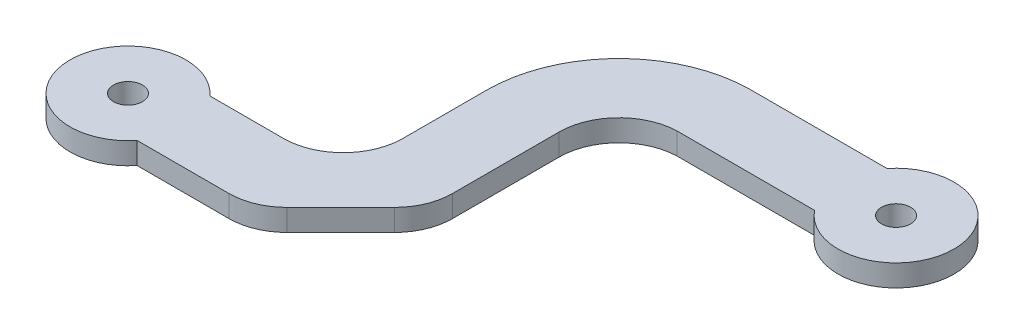
ISO-10303-21;
HEADER;
FILE_DESCRIPTION(('STEP AP214'),'2;1');
FILE_NAME('part.step','',(''),(''),'','','');
FILE_SCHEMA(('AUTOMOTIVE_DESIGN { 1 0 10303 214 1 1 1 1 }'));
ENDSEC;
DATA;
#1=APPLICATION_CONTEXT('core data for automotive mechanical design processes');
#2=APPLICATION_PROTOCOL_DEFINITION('international standard','automotive_design',2000,#1);
#3=PRODUCT_CONTEXT('',#1,'mechanical');
#4=PRODUCT('Part','Part','',(#3));
#5=PRODUCT_RELATED_PRODUCT_CATEGORY('part','',(#4));
#6=PRODUCT_DEFINITION_FORMATION('','',#4);
#7=PRODUCT_DEFINITION_CONTEXT('part definition',#1,'design');
#8=PRODUCT_DEFINITION('design','',#6,#7);
#9=PRODUCT_DEFINITION_SHAPE('','',#8);
#10=(LENGTH_UNIT() NAMED_UNIT(*) SI_UNIT(.MILLI.,.METRE.));
#11=(NAMED_UNIT(*) PLANE_ANGLE_UNIT() SI_UNIT($,.RADIAN.));
#12=(NAMED_UNIT(*) SI_UNIT($,.STERADIAN.) SOLID_ANGLE_UNIT());
#13=UNCERTAINTY_MEASURE_WITH_UNIT(LENGTH_MEASURE(1.E-05),#10,'distance_accuracy_value','');
#14=(GEOMETRIC_REPRESENTATION_CONTEXT(3) GLOBAL_UNCERTAINTY_ASSIGNED_CONTEXT((#13)) GLOBAL_UNIT_ASSIGNED_CONTEXT((#10,
#11,#12)) REPRESENTATION_CONTEXT('',''));
#15=CARTESIAN_POINT('',(0.,0.,0.));
#16=DIRECTION('',(0.,0.,1.));
#17=DIRECTION('',(1.,0.,0.));
#18=AXIS2_PLACEMENT_3D('',#15,#16,#17);
#19=CARTESIAN_POINT('',(0.,1.5,-16.6884298667005));
#20=DIRECTION('',(0.,0.,-1.));
#21=DIRECTION('',(-1.,0.,0.));
#22=AXIS2_PLACEMENT_3D('',#19,#20,#21);
#23=PLANE('',#22);
#24=DIRECTION('',(1.,0.,0.));
#25=VECTOR('',#24,1.);
#26=CARTESIAN_POINT('',(0.,0.,-16.6884298667005));
#27=LINE('',#26,#25);
#28=CARTESIAN_POINT('',(21.1654014208039,0.,-16.6884298667005));
#29=VERTEX_POINT('',#28);
#30=CARTESIAN_POINT('',(30.6654014208039,0.,-16.6884298667005));
#31=VERTEX_POINT('',#30);
#32=EDGE_CURVE('E177',#29,#31,#27,.T.);
#33=ORIENTED_EDGE('',*,*,#32,.T.);
#34=DIRECTION('',(0.,-1.,0.));
#35=VECTOR('',#34,1.);
#36=CARTESIAN_POINT('',(30.6654014208039,1.5,-16.6884298667005));
#37=LINE('',#36,#35);
#38=CARTESIAN_POINT('',(30.6654014208039,1.5,-16.6884298667005));
#39=VERTEX_POINT('',#38);
#40=EDGE_CURVE('E156',#39,#31,#37,.T.);
#41=ORIENTED_EDGE('',*,*,#40,.F.);
#42=DIRECTION('',(1.,0.,0.));
#43=VECTOR('',#42,1.);
#44=CARTESIAN_POINT('',(0.,1.5,-16.6884298667005));
#45=LINE('',#44,#43);
#46=CARTESIAN_POINT('',(21.1654014208039,1.5,-16.6884298667005));
#47=VERTEX_POINT('',#46);
#48=EDGE_CURVE('E164',#47,#39,#45,.T.);
#49=ORIENTED_EDGE('',*,*,#48,.F.);
#50=DIRECTION('',(0.,-1.,0.));
#51=VECTOR('',#50,1.);
#52=CARTESIAN_POINT('',(21.1654014208039,1.5,-16.6884298667005));
#53=LINE('',#52,#51);
#54=EDGE_CURVE('E254',#47,#29,#53,.T.);
#55=ORIENTED_EDGE('',*,*,#54,.T.);
#56=EDGE_LOOP('',(#33,#41,#49,#55));
#57=FACE_BOUND('',#56,.T.);
#58=ADVANCED_FACE('F45',(#57),#23,.F.);
#59=CARTESIAN_POINT('',(33.7879004200031,1.5,-19.1884298667005));
#60=DIRECTION('',(0.,-1.,0.));
#61=DIRECTION('',(0.,0.,-1.));
#62=AXIS2_PLACEMENT_3D('',#59,#60,#61);
#63=CYLINDRICAL_SURFACE('',#62,4.);
#64=CARTESIAN_POINT('',(33.7879004200031,0.,-19.1884298667005));
#65=DIRECTION('',(0.,1.,0.));
#66=DIRECTION('',(0.,0.,1.));
#67=AXIS2_PLACEMENT_3D('',#64,#65,#66);
#68=CIRCLE('',#67,4.);
#69=CARTESIAN_POINT('',(30.6654014208039,0.,-21.6884298667005));
#70=VERTEX_POINT('',#69);
#71=EDGE_CURVE('E257',#31,#70,#68,.T.);
#72=ORIENTED_EDGE('',*,*,#71,.T.);
#73=DIRECTION('',(0.,-1.,0.));
#74=VECTOR('',#73,1.);
#75=CARTESIAN_POINT('',(30.6654014208039,1.5,-21.6884298667005));
#76=LINE('',#75,#74);
#77=CARTESIAN_POINT('',(30.6654014208039,1.5,-21.6884298667005));
#78=VERTEX_POINT('',#77);
#79=EDGE_CURVE('E158',#78,#70,#76,.T.);
#80=ORIENTED_EDGE('',*,*,#79,.F.);
#81=CARTESIAN_POINT('',(33.7879004200031,1.5,-19.1884298667005));
#82=DIRECTION('',(0.,1.,0.));
#83=DIRECTION('',(0.,0.,1.));
#84=AXIS2_PLACEMENT_3D('',#81,#82,#83);
#85=CIRCLE('',#84,4.);
#86=EDGE_CURVE('E151',#39,#78,#85,.T.);
#87=ORIENTED_EDGE('',*,*,#86,.F.);
#88=ORIENTED_EDGE('',*,*,#40,.T.);
#89=EDGE_LOOP('',(#72,#80,#87,#88));
#90=FACE_BOUND('',#89,.T.);
#91=ADVANCED_FACE('F154',(#90),#63,.T.);
#92=CARTESIAN_POINT('',(0.,1.5,-21.6884298667005));
#93=DIRECTION('',(0.,0.,-1.));
#94=DIRECTION('',(-1.,0.,0.));
#95=AXIS2_PLACEMENT_3D('',#92,#93,#94);
#96=PLANE('',#95);
#97=DIRECTION('',(1.,0.,0.));
#98=VECTOR('',#97,1.);
#99=CARTESIAN_POINT('',(0.,0.,-21.6884298667005));
#100=LINE('',#99,#98);
#101=CARTESIAN_POINT('',(21.1654014208039,0.,-21.6884298667005));
#102=VERTEX_POINT('',#101);
#103=EDGE_CURVE('E260',#102,#70,#100,.T.);
#104=ORIENTED_EDGE('',*,*,#103,.F.);
#105=DIRECTION('',(0.,-1.,0.));
#106=VECTOR('',#105,1.);
#107=CARTESIAN_POINT('',(21.1654014208039,1.5,-21.6884298667005));
#108=LINE('',#107,#106);
#109=CARTESIAN_POINT('',(21.1654014208039,1.5,-21.6884298667005));
#110=VERTEX_POINT('',#109);
#111=EDGE_CURVE('E186',#110,#102,#108,.T.);
#112=ORIENTED_EDGE('',*,*,#111,.F.);
#113=DIRECTION('',(1.,0.,0.));
#114=VECTOR('',#113,1.);
#115=CARTESIAN_POINT('',(0.,1.5,-21.6884298667005));
#116=LINE('',#115,#114);
#117=EDGE_CURVE('E163',#110,#78,#116,.T.);
#118=ORIENTED_EDGE('',*,*,#117,.T.);
#119=ORIENTED_EDGE('',*,*,#79,.T.);
#120=EDGE_LOOP('',(#104,#112,#118,#119));
#121=FACE_BOUND('',#120,.T.);
#122=ADVANCED_FACE('F322',(#121),#96,.T.);
#123=CARTESIAN_POINT('',(21.3121067344316,1.5,-12.5528340469568));
#124=DIRECTION('',(0.,-1.,0.));
#125=DIRECTION('',(0.,0.,-1.));
#126=AXIS2_PLACEMENT_3D('',#123,#124,#125);
#127=CYLINDRICAL_SURFACE('',#126,9.13677368827553);
#128=CARTESIAN_POINT('',(21.3121067344316,0.,-12.5528340469568));
#129=DIRECTION('',(0.,1.,0.));
#130=DIRECTION('',(0.,0.,1.));
#131=AXIS2_PLACEMENT_3D('',#128,#129,#130);
#132=CIRCLE('',#131,9.13677368827553);
#133=CARTESIAN_POINT('',(12.175333046156,0.,-12.5528340469568));
#134=VERTEX_POINT('',#133);
#135=EDGE_CURVE('E264',#134,#102,#132,.F.);
#136=ORIENTED_EDGE('',*,*,#135,.F.);
#137=DIRECTION('',(0.,-1.,0.));
#138=VECTOR('',#137,1.);
#139=CARTESIAN_POINT('',(12.175333046156,1.5,-12.5528340469568));
#140=LINE('',#139,#138);
#141=CARTESIAN_POINT('',(12.175333046156,1.5,-12.5528340469568));
#142=VERTEX_POINT('',#141);
#143=EDGE_CURVE('E313',#142,#134,#140,.T.);
#144=ORIENTED_EDGE('',*,*,#143,.F.);
#145=CARTESIAN_POINT('',(21.3121067344316,1.5,-12.5528340469568));
#146=DIRECTION('',(0.,1.,0.));
#147=DIRECTION('',(0.,0.,1.));
#148=AXIS2_PLACEMENT_3D('',#145,#146,#147);
#149=CIRCLE('',#148,9.13677368827553);
#150=EDGE_CURVE('E225',#142,#110,#149,.F.);
#151=ORIENTED_EDGE('',*,*,#150,.T.);
#152=ORIENTED_EDGE('',*,*,#111,.T.);
#153=EDGE_LOOP('',(#136,#144,#151,#152));
#154=FACE_BOUND('',#153,.T.);
#155=ADVANCED_FACE('F319',(#154),#127,.T.);
#156=CARTESIAN_POINT('',(12.175333046156,1.5,0.));
#157=DIRECTION('',(1.,0.,0.));
#158=DIRECTION('',(0.,0.,-1.));
#159=AXIS2_PLACEMENT_3D('',#156,#157,#158);
#160=PLANE('',#159);
#161=DIRECTION('',(0.,0.,1.));
#162=VECTOR('',#161,1.);
#163=CARTESIAN_POINT('',(12.175333046156,0.,0.));
#164=LINE('',#163,#162);
#165=CARTESIAN_POINT('',(12.175333046156,0.,-6.79016646565049));
#166=VERTEX_POINT('',#165);
#167=EDGE_CURVE('E268',#134,#166,#164,.T.);
#168=ORIENTED_EDGE('',*,*,#167,.T.);
#169=DIRECTION('',(0.,-1.,0.));
#170=VECTOR('',#169,1.);
#171=CARTESIAN_POINT('',(12.175333046156,1.5,-6.79016646565049));
#172=LINE('',#171,#170);
#173=CARTESIAN_POINT('',(12.175333046156,1.5,-6.79016646565049));
#174=VERTEX_POINT('',#173);
#175=EDGE_CURVE('E310',#174,#166,#172,.T.);
#176=ORIENTED_EDGE('',*,*,#175,.F.);
#177=DIRECTION('',(0.,0.,1.));
#178=VECTOR('',#177,1.);
#179=CARTESIAN_POINT('',(12.175333046156,1.5,0.));
#180=LINE('',#179,#178);
#181=EDGE_CURVE('E229',#142,#174,#180,.T.);
#182=ORIENTED_EDGE('',*,*,#181,.F.);
#183=ORIENTED_EDGE('',*,*,#143,.T.);
#184=EDGE_LOOP('',(#168,#176,#182,#183));
#185=FACE_BOUND('',#184,.T.);
#186=ADVANCED_FACE('F330',(#185),#160,.F.);
#187=CARTESIAN_POINT('',(8.05533304633386,1.5,-6.79016646565049));
#188=DIRECTION('',(0.,-1.,0.));
#189=DIRECTION('',(0.,0.,-1.));
#190=AXIS2_PLACEMENT_3D('',#187,#188,#189);
#191=CYLINDRICAL_SURFACE('',#190,4.11999999982218);
#192=CARTESIAN_POINT('',(8.05533304633386,0.,-6.79016646565049));
#193=DIRECTION('',(0.,1.,0.));
#194=DIRECTION('',(0.,0.,1.));
#195=AXIS2_PLACEMENT_3D('',#192,#193,#194);
#196=CIRCLE('',#195,4.11999999982218);
#197=CARTESIAN_POINT('',(8.05533304633386,0.,-2.67016646582831));
#198=VERTEX_POINT('',#197);
#199=EDGE_CURVE('E272',#198,#166,#196,.T.);
#200=ORIENTED_EDGE('',*,*,#199,.F.);
#201=DIRECTION('',(0.,-1.,0.));
#202=VECTOR('',#201,1.);
#203=CARTESIAN_POINT('',(8.05533304633386,1.5,-2.67016646582831));
#204=LINE('',#203,#202);
#205=CARTESIAN_POINT('',(8.05533304633386,1.5,-2.67016646582831));
#206=VERTEX_POINT('',#205);
#207=EDGE_CURVE('E307',#206,#198,#204,.T.);
#208=ORIENTED_EDGE('',*,*,#207,.F.);
#209=CARTESIAN_POINT('',(8.05533304633386,1.5,-6.79016646565049));
#210=DIRECTION('',(0.,1.,0.));
#211=DIRECTION('',(0.,0.,1.));
#212=AXIS2_PLACEMENT_3D('',#209,#210,#211);
#213=CIRCLE('',#212,4.11999999982218);
#214=EDGE_CURVE('E232',#206,#174,#213,.T.);
#215=ORIENTED_EDGE('',*,*,#214,.T.);
#216=ORIENTED_EDGE('',*,*,#175,.T.);
#217=EDGE_LOOP('',(#200,#208,#215,#216));
#218=FACE_BOUND('',#217,.T.);
#219=ADVANCED_FACE('F485',(#218),#191,.F.);
#220=CARTESIAN_POINT('',(0.,1.5,-2.67016646582831));
#221=DIRECTION('',(0.,0.,-1.));
#222=DIRECTION('',(-1.,0.,0.));
#223=AXIS2_PLACEMENT_3D('',#220,#221,#222);
#224=PLANE('',#223);
#225=DIRECTION('',(1.,0.,0.));
#226=VECTOR('',#225,1.);
#227=CARTESIAN_POINT('',(0.,0.,-2.67016646582831));
#228=LINE('',#227,#226);
#229=CARTESIAN_POINT('',(2.97828995310497,0.,-2.67016646582831));
#230=VERTEX_POINT('',#229);
#231=EDGE_CURVE('E276',#230,#198,#228,.T.);
#232=ORIENTED_EDGE('',*,*,#231,.F.);
#233=DIRECTION('',(0.,-1.,0.));
#234=VECTOR('',#233,1.);
#235=CARTESIAN_POINT('',(2.97828995310497,1.5,-2.67016646582831));
#236=LINE('',#235,#234);
#237=CARTESIAN_POINT('',(2.97828995310497,1.5,-2.67016646582831));
#238=VERTEX_POINT('',#237);
#239=EDGE_CURVE('E304',#238,#230,#236,.T.);
#240=ORIENTED_EDGE('',*,*,#239,.F.);
#241=DIRECTION('',(1.,0.,0.));
#242=VECTOR('',#241,1.);
#243=CARTESIAN_POINT('',(0.,1.5,-2.67016646582831));
#244=LINE('',#243,#242);
#245=EDGE_CURVE('E236',#238,#206,#244,.T.);
#246=ORIENTED_EDGE('',*,*,#245,.T.);
#247=ORIENTED_EDGE('',*,*,#207,.T.);
#248=EDGE_LOOP('',(#232,#240,#246,#247));
#249=FACE_BOUND('',#248,.T.);
#250=ADVANCED_FACE('F337',(#249),#224,.T.);
#251=CARTESIAN_POINT('',(0.,1.5,0.));
#252=DIRECTION('',(0.,-1.,0.));
#253=DIRECTION('',(0.,0.,-1.));
#254=AXIS2_PLACEMENT_3D('',#251,#252,#253);
#255=CYLINDRICAL_SURFACE('',#254,4.);
#256=CARTESIAN_POINT('',(0.,0.,0.));
#257=DIRECTION('',(0.,1.,0.));
#258=DIRECTION('',(0.,0.,1.));
#259=AXIS2_PLACEMENT_3D('',#256,#257,#258);
#260=CIRCLE('',#259,4.);
#261=CARTESIAN_POINT('',(3.1224989991992,0.,2.5));
#262=VERTEX_POINT('',#261);
#263=EDGE_CURVE('E280',#230,#262,#260,.T.);
#264=ORIENTED_EDGE('',*,*,#263,.T.);
#265=DIRECTION('',(0.,-1.,0.));
#266=VECTOR('',#265,1.);
#267=CARTESIAN_POINT('',(3.1224989991992,1.5,2.5));
#268=LINE('',#267,#266);
#269=CARTESIAN_POINT('',(3.1224989991992,1.5,2.5));
#270=VERTEX_POINT('',#269);
#271=EDGE_CURVE('E300',#270,#262,#268,.T.);
#272=ORIENTED_EDGE('',*,*,#271,.F.);
#273=CARTESIAN_POINT('',(0.,1.5,0.));
#274=DIRECTION('',(0.,1.,0.));
#275=DIRECTION('',(0.,0.,1.));
#276=AXIS2_PLACEMENT_3D('',#273,#274,#275);
#277=CIRCLE('',#276,4.);
#278=EDGE_CURVE('E240',#238,#270,#277,.T.);
#279=ORIENTED_EDGE('',*,*,#278,.F.);
#280=ORIENTED_EDGE('',*,*,#239,.T.);
#281=EDGE_LOOP('',(#264,#272,#279,#280));
#282=FACE_BOUND('',#281,.T.);
#283=ADVANCED_FACE('F342',(#282),#255,.T.);
#284=CARTESIAN_POINT('',(0.,1.5,2.5));
#285=DIRECTION('',(0.,0.,-1.));
#286=DIRECTION('',(-1.,0.,0.));
#287=AXIS2_PLACEMENT_3D('',#284,#285,#286);
#288=PLANE('',#287);
#289=DIRECTION('',(1.,0.,0.));
#290=VECTOR('',#289,1.);
#291=CARTESIAN_POINT('',(0.,0.,2.5));
#292=LINE('',#291,#290);
#293=CARTESIAN_POINT('',(9.46564474970682,0.,2.5));
#294=VERTEX_POINT('',#293);
#295=EDGE_CURVE('E283',#262,#294,#292,.T.);
#296=ORIENTED_EDGE('',*,*,#295,.T.);
#297=DIRECTION('',(0.,-1.,0.));
#298=VECTOR('',#297,1.);
#299=CARTESIAN_POINT('',(9.46564474970682,1.5,2.5));
#300=LINE('',#299,#298);
#301=CARTESIAN_POINT('',(9.46564474970682,1.5,2.5));
#302=VERTEX_POINT('',#301);
#303=EDGE_CURVE('E11',#294,#302,#300,.F.);
#304=ORIENTED_EDGE('',*,*,#303,.T.);
#305=DIRECTION('',(1.,0.,0.));
#306=VECTOR('',#305,1.);
#307=CARTESIAN_POINT('',(0.,1.5,2.5));
#308=LINE('',#307,#306);
#309=EDGE_CURVE('E243',#270,#302,#308,.T.);
#310=ORIENTED_EDGE('',*,*,#309,.F.);
#311=ORIENTED_EDGE('',*,*,#271,.T.);
#312=EDGE_LOOP('',(#296,#304,#310,#311));
#313=FACE_BOUND('',#312,.T.);
#314=ADVANCED_FACE('F460',(#313),#288,.F.);
#315=CARTESIAN_POINT('',(6.8112494995996,1.5,6.8112494995996));
#316=DIRECTION('',(-0.707106781186548,0.,-0.707106781186547));
#317=DIRECTION('',(-0.707106781186547,0.,0.707106781186548));
#318=AXIS2_PLACEMENT_3D('',#315,#316,#317);
#319=PLANE('',#318);
#320=DIRECTION('',(0.707106781186547,0.,-0.707106781186548));
#321=VECTOR('',#320,1.);
#322=CARTESIAN_POINT('',(6.8112494995996,0.,6.8112494995996));
#323=LINE('',#322,#321);
#324=CARTESIAN_POINT('',(12.294071874453,0.,1.32842712474619));
#325=VERTEX_POINT('',#324);
#326=CARTESIAN_POINT('',(16.0037601709022,0.,-2.38126117170304));
#327=VERTEX_POINT('',#326);
#328=EDGE_CURVE('E286',#325,#327,#323,.T.);
#329=ORIENTED_EDGE('',*,*,#328,.T.);
#330=DIRECTION('',(0.,-1.,0.));
#331=VECTOR('',#330,1.);
#332=CARTESIAN_POINT('',(16.0037601709022,1.5,-2.38126117170304));
#333=LINE('',#332,#331);
#334=CARTESIAN_POINT('',(16.0037601709022,1.5,-2.38126117170304));
#335=VERTEX_POINT('',#334);
#336=EDGE_CURVE('E69',#327,#335,#333,.F.);
#337=ORIENTED_EDGE('',*,*,#336,.T.);
#338=DIRECTION('',(0.707106781186547,0.,-0.707106781186548));
#339=VECTOR('',#338,1.);
#340=CARTESIAN_POINT('',(6.8112494995996,1.5,6.8112494995996));
#341=LINE('',#340,#339);
#342=CARTESIAN_POINT('',(12.294071874453,1.5,1.32842712474619));
#343=VERTEX_POINT('',#342);
#344=EDGE_CURVE('E246',#343,#335,#341,.T.);
#345=ORIENTED_EDGE('',*,*,#344,.F.);
#346=DIRECTION('',(0.,-1.,0.));
#347=VECTOR('',#346,1.);
#348=CARTESIAN_POINT('',(12.294071874453,1.5,1.32842712474619));
#349=LINE('',#348,#347);
#350=EDGE_CURVE('E195',#343,#325,#349,.T.);
#351=ORIENTED_EDGE('',*,*,#350,.T.);
#352=EDGE_LOOP('',(#329,#337,#345,#351));
#353=FACE_BOUND('',#352,.T.);
#354=ADVANCED_FACE('F347',(#353),#319,.F.);
#355=CARTESIAN_POINT('',(17.175333046156,1.5,0.));
#356=DIRECTION('',(-1.,0.,0.));
#357=DIRECTION('',(0.,0.,1.));
#358=AXIS2_PLACEMENT_3D('',#355,#356,#357);
#359=PLANE('',#358);
#360=DIRECTION('',(0.,0.,-1.));
#361=VECTOR('',#360,1.);
#362=CARTESIAN_POINT('',(17.175333046156,1.5,0.));
#363=LINE('',#362,#361);
#364=CARTESIAN_POINT('',(17.175333046156,1.5,-5.20968829644923));
#365=VERTEX_POINT('',#364);
#366=CARTESIAN_POINT('',(17.175333046156,1.5,-12.5528340469568));
#367=VERTEX_POINT('',#366);
#368=EDGE_CURVE('E249',#365,#367,#363,.T.);
#369=ORIENTED_EDGE('',*,*,#368,.F.);
#370=DIRECTION('',(0.,-1.,0.));
#371=VECTOR('',#370,1.);
#372=CARTESIAN_POINT('',(17.175333046156,1.5,-5.20968829644923));
#373=LINE('',#372,#371);
#374=CARTESIAN_POINT('',(17.175333046156,0.,-5.20968829644923));
#375=VERTEX_POINT('',#374);
#376=EDGE_CURVE('E179',#365,#375,#373,.T.);
#377=ORIENTED_EDGE('',*,*,#376,.T.);
#378=DIRECTION('',(0.,0.,-1.));
#379=VECTOR('',#378,1.);
#380=CARTESIAN_POINT('',(17.175333046156,0.,0.));
#381=LINE('',#380,#379);
#382=CARTESIAN_POINT('',(17.175333046156,0.,-12.5528340469568));
#383=VERTEX_POINT('',#382);
#384=EDGE_CURVE('E289',#375,#383,#381,.T.);
#385=ORIENTED_EDGE('',*,*,#384,.T.);
#386=DIRECTION('',(0.,-1.,0.));
#387=VECTOR('',#386,1.);
#388=CARTESIAN_POINT('',(17.175333046156,1.5,-12.5528340469568));
#389=LINE('',#388,#387);
#390=EDGE_CURVE('E296',#367,#383,#389,.T.);
#391=ORIENTED_EDGE('',*,*,#390,.F.);
#392=EDGE_LOOP('',(#369,#377,#385,#391));
#393=FACE_BOUND('',#392,.T.);
#394=ADVANCED_FACE('F356',(#393),#359,.F.);
#395=CARTESIAN_POINT('',(21.3135827348673,1.5,-12.5528340469568));
#396=DIRECTION('',(0.,-1.,0.));
#397=DIRECTION('',(0.,0.,-1.));
#398=AXIS2_PLACEMENT_3D('',#395,#396,#397);
#399=CYLINDRICAL_SURFACE('',#398,4.13824968871123);
#400=CARTESIAN_POINT('',(21.3135827348673,0.,-12.5528340469568));
#401=DIRECTION('',(0.,1.,0.));
#402=DIRECTION('',(0.,0.,1.));
#403=AXIS2_PLACEMENT_3D('',#400,#401,#402);
#404=CIRCLE('',#403,4.13824968871123);
#405=EDGE_CURVE('E174',#383,#29,#404,.F.);
#406=ORIENTED_EDGE('',*,*,#405,.T.);
#407=ORIENTED_EDGE('',*,*,#54,.F.);
#408=CARTESIAN_POINT('',(21.3135827348673,1.5,-12.5528340469568));
#409=DIRECTION('',(0.,1.,0.));
#410=DIRECTION('',(0.,0.,1.));
#411=AXIS2_PLACEMENT_3D('',#408,#409,#410);
#412=CIRCLE('',#411,4.13824968871123);
#413=EDGE_CURVE('E169',#367,#47,#412,.F.);
#414=ORIENTED_EDGE('',*,*,#413,.F.);
#415=ORIENTED_EDGE('',*,*,#390,.T.);
#416=EDGE_LOOP('',(#406,#407,#414,#415));
#417=FACE_BOUND('',#416,.T.);
#418=ADVANCED_FACE('F359',(#417),#399,.F.);
#419=CARTESIAN_POINT('',(0.,1.5,0.));
#420=DIRECTION('',(0.,1.,0.));
#421=DIRECTION('',(0.,0.,1.));
#422=AXIS2_PLACEMENT_3D('',#419,#420,#421);
#423=PLANE('',#422);
#424=CARTESIAN_POINT('',(0.,1.5,0.));
#425=DIRECTION('',(0.,1.,0.));
#426=DIRECTION('',(0.,0.,1.));
#427=AXIS2_PLACEMENT_3D('',#424,#425,#426);
#428=CIRCLE('',#427,1.);
#429=CARTESIAN_POINT('',(0.,1.5,1.));
#430=VERTEX_POINT('',#429);
#431=EDGE_CURVE('E208',#430,#430,#428,.T.);
#432=ORIENTED_EDGE('',*,*,#431,.F.);
#433=EDGE_LOOP('',(#432));
#434=FACE_BOUND('',#433,.T.);
#435=CARTESIAN_POINT('',(33.7879004200031,1.5,-19.1884298667005));
#436=DIRECTION('',(0.,1.,0.));
#437=DIRECTION('',(0.,0.,1.));
#438=AXIS2_PLACEMENT_3D('',#435,#436,#437);
#439=CIRCLE('',#438,0.999999999999998);
#440=CARTESIAN_POINT('',(33.7879004200031,1.5,-18.1884298667005));
#441=VERTEX_POINT('',#440);
#442=EDGE_CURVE('E215',#441,#441,#439,.T.);
#443=ORIENTED_EDGE('',*,*,#442,.F.);
#444=EDGE_LOOP('',(#443));
#445=FACE_BOUND('',#444,.T.);
#446=ORIENTED_EDGE('',*,*,#344,.T.);
#447=CARTESIAN_POINT('',(13.175333046156,1.5,-5.20968829644923));
#448=DIRECTION('',(0.,1.,0.));
#449=DIRECTION('',(0.,0.,1.));
#450=AXIS2_PLACEMENT_3D('',#447,#448,#449);
#451=CIRCLE('',#450,4.);
#452=EDGE_CURVE('E55',#335,#365,#451,.T.);
#453=ORIENTED_EDGE('',*,*,#452,.T.);
#454=ORIENTED_EDGE('',*,*,#368,.T.);
#455=ORIENTED_EDGE('',*,*,#413,.T.);
#456=ORIENTED_EDGE('',*,*,#48,.T.);
#457=ORIENTED_EDGE('',*,*,#86,.T.);
#458=ORIENTED_EDGE('',*,*,#117,.F.);
#459=ORIENTED_EDGE('',*,*,#150,.F.);
#460=ORIENTED_EDGE('',*,*,#181,.T.);
#461=ORIENTED_EDGE('',*,*,#214,.F.);
#462=ORIENTED_EDGE('',*,*,#245,.F.);
#463=ORIENTED_EDGE('',*,*,#278,.T.);
#464=ORIENTED_EDGE('',*,*,#309,.T.);
#465=CARTESIAN_POINT('',(9.46564474970682,1.5,-1.5));
#466=DIRECTION('',(0.,1.,0.));
#467=DIRECTION('',(0.,0.,1.));
#468=AXIS2_PLACEMENT_3D('',#465,#466,#467);
#469=CIRCLE('',#468,4.);
#470=EDGE_CURVE('E201',#302,#343,#469,.T.);
#471=ORIENTED_EDGE('',*,*,#470,.T.);
#472=EDGE_LOOP('',(#446,#453,#454,#455,#456,#457,#458,#459,#460,#461,#462,#463,#464,#471));
#473=FACE_BOUND('',#472,.T.);
#474=ADVANCED_FACE('F167',(#434,#445,#473),#423,.T.);
#475=CARTESIAN_POINT('',(0.,0.,0.));
#476=DIRECTION('',(0.,1.,0.));
#477=DIRECTION('',(0.,0.,1.));
#478=AXIS2_PLACEMENT_3D('',#475,#476,#477);
#479=PLANE('',#478);
#480=CARTESIAN_POINT('',(0.,0.,0.));
#481=DIRECTION('',(0.,1.,0.));
#482=DIRECTION('',(0.,0.,1.));
#483=AXIS2_PLACEMENT_3D('',#480,#481,#482);
#484=CIRCLE('',#483,1.);
#485=CARTESIAN_POINT('',(0.,0.,1.));
#486=VERTEX_POINT('',#485);
#487=EDGE_CURVE('E49',#486,#486,#484,.T.);
#488=ORIENTED_EDGE('',*,*,#487,.T.);
#489=EDGE_LOOP('',(#488));
#490=FACE_BOUND('',#489,.T.);
#491=CARTESIAN_POINT('',(33.7879004200031,0.,-19.1884298667005));
#492=DIRECTION('',(0.,1.,0.));
#493=DIRECTION('',(0.,0.,1.));
#494=AXIS2_PLACEMENT_3D('',#491,#492,#493);
#495=CIRCLE('',#494,0.999999999999998);
#496=CARTESIAN_POINT('',(33.7879004200031,0.,-18.1884298667005));
#497=VERTEX_POINT('',#496);
#498=EDGE_CURVE('E205',#497,#497,#495,.T.);
#499=ORIENTED_EDGE('',*,*,#498,.T.);
#500=EDGE_LOOP('',(#499));
#501=FACE_BOUND('',#500,.T.);
#502=ORIENTED_EDGE('',*,*,#384,.F.);
#503=CARTESIAN_POINT('',(13.175333046156,0.,-5.20968829644923));
#504=DIRECTION('',(0.,1.,0.));
#505=DIRECTION('',(0.,0.,1.));
#506=AXIS2_PLACEMENT_3D('',#503,#504,#505);
#507=CIRCLE('',#506,4.);
#508=EDGE_CURVE('E192',#375,#327,#507,.F.);
#509=ORIENTED_EDGE('',*,*,#508,.T.);
#510=ORIENTED_EDGE('',*,*,#328,.F.);
#511=CARTESIAN_POINT('',(9.46564474970682,0.,-1.5));
#512=DIRECTION('',(0.,1.,0.));
#513=DIRECTION('',(0.,0.,1.));
#514=AXIS2_PLACEMENT_3D('',#511,#512,#513);
#515=CIRCLE('',#514,4.);
#516=EDGE_CURVE('E184',#325,#294,#515,.F.);
#517=ORIENTED_EDGE('',*,*,#516,.T.);
#518=ORIENTED_EDGE('',*,*,#295,.F.);
#519=ORIENTED_EDGE('',*,*,#263,.F.);
#520=ORIENTED_EDGE('',*,*,#231,.T.);
#521=ORIENTED_EDGE('',*,*,#199,.T.);
#522=ORIENTED_EDGE('',*,*,#167,.F.);
#523=ORIENTED_EDGE('',*,*,#135,.T.);
#524=ORIENTED_EDGE('',*,*,#103,.T.);
#525=ORIENTED_EDGE('',*,*,#71,.F.);
#526=ORIENTED_EDGE('',*,*,#32,.F.);
#527=ORIENTED_EDGE('',*,*,#405,.F.);
#528=EDGE_LOOP('',(#502,#509,#510,#517,#518,#519,#520,#521,#522,#523,#524,#525,#526,#527));
#529=FACE_BOUND('',#528,.T.);
#530=ADVANCED_FACE('F326',(#490,#501,#529),#479,.F.);
#531=CARTESIAN_POINT('',(13.175333046156,1.5,-5.20968829644923));
#532=DIRECTION('',(0.,-1.,0.));
#533=DIRECTION('',(0.,0.,-1.));
#534=AXIS2_PLACEMENT_3D('',#531,#532,#533);
#535=CYLINDRICAL_SURFACE('',#534,4.);
#536=ORIENTED_EDGE('',*,*,#452,.F.);
#537=ORIENTED_EDGE('',*,*,#336,.F.);
#538=ORIENTED_EDGE('',*,*,#508,.F.);
#539=ORIENTED_EDGE('',*,*,#376,.F.);
#540=EDGE_LOOP('',(#536,#537,#538,#539));
#541=FACE_BOUND('',#540,.T.);
#542=ADVANCED_FACE('F353',(#541),#535,.T.);
#543=CARTESIAN_POINT('',(9.46564474970682,1.5,-1.5));
#544=DIRECTION('',(0.,-1.,0.));
#545=DIRECTION('',(0.,0.,-1.));
#546=AXIS2_PLACEMENT_3D('',#543,#544,#545);
#547=CYLINDRICAL_SURFACE('',#546,4.);
#548=ORIENTED_EDGE('',*,*,#470,.F.);
#549=ORIENTED_EDGE('',*,*,#303,.F.);
#550=ORIENTED_EDGE('',*,*,#516,.F.);
#551=ORIENTED_EDGE('',*,*,#350,.F.);
#552=EDGE_LOOP('',(#548,#549,#550,#551));
#553=FACE_BOUND('',#552,.T.);
#554=ADVANCED_FACE('F47',(#553),#547,.T.);
#555=CARTESIAN_POINT('',(33.7879004200031,-10.,-19.1884298667005));
#556=DIRECTION('',(0.,1.,0.));
#557=DIRECTION('',(0.,0.,1.));
#558=AXIS2_PLACEMENT_3D('',#555,#556,#557);
#559=CYLINDRICAL_SURFACE('',#558,0.999999999999998);
#560=ORIENTED_EDGE('',*,*,#442,.T.);
#561=EDGE_LOOP('',(#560));
#562=FACE_BOUND('',#561,.T.);
#563=ORIENTED_EDGE('',*,*,#498,.F.);
#564=EDGE_LOOP('',(#563));
#565=FACE_BOUND('',#564,.T.);
#566=ADVANCED_FACE('F382',(#562,#565),#559,.F.);
#567=CARTESIAN_POINT('',(0.,-10.,0.));
#568=DIRECTION('',(0.,1.,0.));
#569=DIRECTION('',(0.,0.,1.));
#570=AXIS2_PLACEMENT_3D('',#567,#568,#569);
#571=CYLINDRICAL_SURFACE('',#570,1.);
#572=ORIENTED_EDGE('',*,*,#431,.T.);
#573=EDGE_LOOP('',(#572));
#574=FACE_BOUND('',#573,.T.);
#575=ORIENTED_EDGE('',*,*,#487,.F.);
#576=EDGE_LOOP('',(#575));
#577=FACE_BOUND('',#576,.T.);
#578=ADVANCED_FACE('F389',(#574,#577),#571,.F.);
#579=CLOSED_SHELL('',(#58,#91,#122,#155,#186,#219,#250,#283,#314,#354,#394,#418,#474,#530,#542,
#554,#566,#578));
#580=MANIFOLD_SOLID_BREP('B2',#579);
#581=ADVANCED_BREP_SHAPE_REPRESENTATION('',(#18,#580),#14);
#582=SHAPE_DEFINITION_REPRESENTATION(#9,#581);
ENDSEC;
END-ISO-10303-21;
